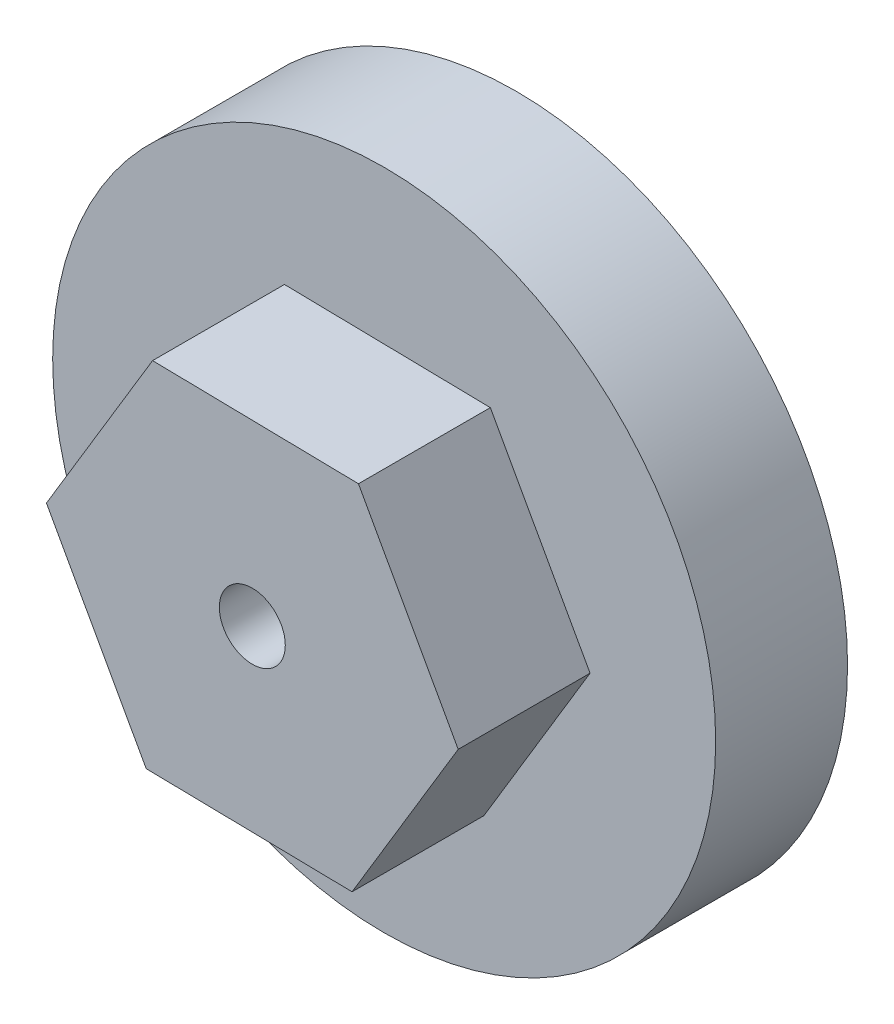
ISO-10303-21;
HEADER;
FILE_DESCRIPTION(('STEP AP214'),'2;1');
FILE_NAME('part.step','',(''),(''),'','','');
FILE_SCHEMA(('AUTOMOTIVE_DESIGN { 1 0 10303 214 1 1 1 1 }'));
ENDSEC;
DATA;
#1=APPLICATION_CONTEXT('core data for automotive mechanical design processes');
#2=APPLICATION_PROTOCOL_DEFINITION('international standard','automotive_design',2000,#1);
#3=PRODUCT_CONTEXT('',#1,'mechanical');
#4=PRODUCT('Part','Part','',(#3));
#5=PRODUCT_RELATED_PRODUCT_CATEGORY('part','',(#4));
#6=PRODUCT_DEFINITION_FORMATION('','',#4);
#7=PRODUCT_DEFINITION_CONTEXT('part definition',#1,'design');
#8=PRODUCT_DEFINITION('design','',#6,#7);
#9=PRODUCT_DEFINITION_SHAPE('','',#8);
#10=(LENGTH_UNIT() NAMED_UNIT(*) SI_UNIT(.MILLI.,.METRE.));
#11=(NAMED_UNIT(*) PLANE_ANGLE_UNIT() SI_UNIT($,.RADIAN.));
#12=(NAMED_UNIT(*) SI_UNIT($,.STERADIAN.) SOLID_ANGLE_UNIT());
#13=UNCERTAINTY_MEASURE_WITH_UNIT(LENGTH_MEASURE(1.E-05),#10,'distance_accuracy_value','');
#14=(GEOMETRIC_REPRESENTATION_CONTEXT(3) GLOBAL_UNCERTAINTY_ASSIGNED_CONTEXT((#13)) GLOBAL_UNIT_ASSIGNED_CONTEXT((#10,
#11,#12)) REPRESENTATION_CONTEXT('',''));
#15=CARTESIAN_POINT('',(0.,0.,0.));
#16=DIRECTION('',(0.,0.,1.));
#17=DIRECTION('',(1.,0.,0.));
#18=AXIS2_PLACEMENT_3D('',#15,#16,#17);
#19=CARTESIAN_POINT('',(0.,0.,10.));
#20=DIRECTION('',(0.,0.,-1.));
#21=DIRECTION('',(-1.,0.,0.));
#22=AXIS2_PLACEMENT_3D('',#19,#20,#21);
#23=CYLINDRICAL_SURFACE('',#22,25.1393111837615);
#24=CARTESIAN_POINT('',(0.,0.,10.));
#25=DIRECTION('',(0.,0.,1.));
#26=DIRECTION('',(1.,0.,0.));
#27=AXIS2_PLACEMENT_3D('',#24,#25,#26);
#28=CIRCLE('',#27,25.1393111837615);
#29=CARTESIAN_POINT('',(25.1393111837615,0.,10.));
#30=VERTEX_POINT('',#29);
#31=EDGE_CURVE('E11',#30,#30,#28,.T.);
#32=ORIENTED_EDGE('',*,*,#31,.F.);
#33=EDGE_LOOP('',(#32));
#34=FACE_BOUND('',#33,.T.);
#35=CARTESIAN_POINT('',(0.,0.,0.));
#36=DIRECTION('',(0.,0.,1.));
#37=DIRECTION('',(1.,0.,0.));
#38=AXIS2_PLACEMENT_3D('',#35,#36,#37);
#39=CIRCLE('',#38,25.1393111837615);
#40=CARTESIAN_POINT('',(25.1393111837615,0.,0.));
#41=VERTEX_POINT('',#40);
#42=EDGE_CURVE('E39',#41,#41,#39,.T.);
#43=ORIENTED_EDGE('',*,*,#42,.T.);
#44=EDGE_LOOP('',(#43));
#45=FACE_BOUND('',#44,.T.);
#46=ADVANCED_FACE('F36',(#34,#45),#23,.T.);
#47=CARTESIAN_POINT('',(0.,0.,10.));
#48=DIRECTION('',(0.,0.,1.));
#49=DIRECTION('',(1.,0.,0.));
#50=AXIS2_PLACEMENT_3D('',#47,#48,#49);
#51=PLANE('',#50);
#52=DIRECTION('',(-0.484355771750232,0.874871125579212,0.));
#53=VECTOR('',#52,1.);
#54=CARTESIAN_POINT('',(11.8305831403045,6.5497775153841,10.));
#55=LINE('',#54,#53);
#56=CARTESIAN_POINT('',(15.6120989519437,-0.280612845340982,10.));
#57=VERTEX_POINT('',#56);
#58=CARTESIAN_POINT('',(8.04906732866538,13.3801678761092,10.));
#59=VERTEX_POINT('',#58);
#60=EDGE_CURVE('E112',#57,#59,#55,.T.);
#61=ORIENTED_EDGE('',*,*,#60,.F.);
#62=DIRECTION('',(0.515482733913967,0.856899965594924,0.));
#63=VECTOR('',#62,1.);
#64=CARTESIAN_POINT('',(11.587565287611,-6.97069678339557,10.));
#65=LINE('',#64,#63);
#66=CARTESIAN_POINT('',(7.56303162327833,-13.6607807214502,10.));
#67=VERTEX_POINT('',#66);
#68=EDGE_CURVE('E109',#67,#57,#65,.T.);
#69=ORIENTED_EDGE('',*,*,#68,.F.);
#70=DIRECTION('',(0.9998385056642,-0.0179711599842875,0.));
#71=VECTOR('',#70,1.);
#72=CARTESIAN_POINT('',(-0.243017852693525,-13.5204742987797,10.));
#73=LINE('',#72,#71);
#74=CARTESIAN_POINT('',(-8.04906732866537,-13.3801678761092,10.));
#75=VERTEX_POINT('',#74);
#76=EDGE_CURVE('E119',#75,#67,#73,.T.);
#77=ORIENTED_EDGE('',*,*,#76,.F.);
#78=DIRECTION('',(0.484355771750232,-0.874871125579212,0.));
#79=VECTOR('',#78,1.);
#80=CARTESIAN_POINT('',(-11.8305831403045,-6.54977751538409,10.));
#81=LINE('',#80,#79);
#82=CARTESIAN_POINT('',(-15.6120989519437,0.280612845340986,10.));
#83=VERTEX_POINT('',#82);
#84=EDGE_CURVE('E122',#83,#75,#81,.T.);
#85=ORIENTED_EDGE('',*,*,#84,.F.);
#86=DIRECTION('',(-0.515482733913967,-0.856899965594924,0.));
#87=VECTOR('',#86,1.);
#88=CARTESIAN_POINT('',(-11.587565287611,6.97069678339557,10.));
#89=LINE('',#88,#87);
#90=CARTESIAN_POINT('',(-7.56303162327833,13.6607807214502,10.));
#91=VERTEX_POINT('',#90);
#92=EDGE_CURVE('E55',#91,#83,#89,.T.);
#93=ORIENTED_EDGE('',*,*,#92,.F.);
#94=DIRECTION('',(-0.9998385056642,0.0179711599842874,0.));
#95=VECTOR('',#94,1.);
#96=CARTESIAN_POINT('',(0.243017852693523,13.5204742987797,10.));
#97=LINE('',#96,#95);
#98=EDGE_CURVE('E44',#59,#91,#97,.T.);
#99=ORIENTED_EDGE('',*,*,#98,.F.);
#100=EDGE_LOOP('',(#61,#69,#77,#85,#93,#99));
#101=FACE_BOUND('',#100,.T.);
#102=ORIENTED_EDGE('',*,*,#31,.T.);
#103=EDGE_LOOP('',(#102));
#104=FACE_BOUND('',#103,.T.);
#105=ADVANCED_FACE('F167',(#101,#104),#51,.T.);
#106=CARTESIAN_POINT('',(0.,0.,0.));
#107=DIRECTION('',(0.,0.,1.));
#108=DIRECTION('',(1.,0.,0.));
#109=AXIS2_PLACEMENT_3D('',#106,#107,#108);
#110=PLANE('',#109);
#111=ORIENTED_EDGE('',*,*,#42,.F.);
#112=EDGE_LOOP('',(#111));
#113=FACE_BOUND('',#112,.T.);
#114=CARTESIAN_POINT('',(0.,0.,0.));
#115=DIRECTION('',(0.,0.,1.));
#116=DIRECTION('',(1.,0.,0.));
#117=AXIS2_PLACEMENT_3D('',#114,#115,#116);
#118=CIRCLE('',#117,2.5);
#119=CARTESIAN_POINT('',(2.5,0.,0.));
#120=VERTEX_POINT('',#119);
#121=EDGE_CURVE('E144',#120,#120,#118,.T.);
#122=ORIENTED_EDGE('',*,*,#121,.T.);
#123=EDGE_LOOP('',(#122));
#124=FACE_BOUND('',#123,.T.);
#125=ADVANCED_FACE('F172',(#113,#124),#110,.F.);
#126=CARTESIAN_POINT('',(11.587565287611,-6.97069678339557,20.));
#127=DIRECTION('',(-0.856899965594924,0.515482733913967,0.));
#128=DIRECTION('',(-0.515482733913967,-0.856899965594924,0.));
#129=AXIS2_PLACEMENT_3D('',#126,#127,#128);
#130=PLANE('',#129);
#131=ORIENTED_EDGE('',*,*,#68,.T.);
#132=DIRECTION('',(0.,0.,-1.));
#133=VECTOR('',#132,1.);
#134=CARTESIAN_POINT('',(15.6120989519437,-0.280612845340982,20.));
#135=LINE('',#134,#133);
#136=CARTESIAN_POINT('',(15.6120989519437,-0.280612845340982,20.));
#137=VERTEX_POINT('',#136);
#138=EDGE_CURVE('E90',#137,#57,#135,.T.);
#139=ORIENTED_EDGE('',*,*,#138,.F.);
#140=DIRECTION('',(0.515482733913967,0.856899965594924,0.));
#141=VECTOR('',#140,1.);
#142=CARTESIAN_POINT('',(11.587565287611,-6.97069678339557,20.));
#143=LINE('',#142,#141);
#144=CARTESIAN_POINT('',(7.56303162327833,-13.6607807214502,20.));
#145=VERTEX_POINT('',#144);
#146=EDGE_CURVE('E96',#145,#137,#143,.T.);
#147=ORIENTED_EDGE('',*,*,#146,.F.);
#148=DIRECTION('',(0.,0.,-1.));
#149=VECTOR('',#148,1.);
#150=CARTESIAN_POINT('',(7.56303162327833,-13.6607807214502,20.));
#151=LINE('',#150,#149);
#152=EDGE_CURVE('E142',#145,#67,#151,.T.);
#153=ORIENTED_EDGE('',*,*,#152,.T.);
#154=EDGE_LOOP('',(#131,#139,#147,#153));
#155=FACE_BOUND('',#154,.T.);
#156=ADVANCED_FACE('F108',(#155),#130,.F.);
#157=CARTESIAN_POINT('',(11.8305831403045,6.5497775153841,20.));
#158=DIRECTION('',(-0.874871125579212,-0.484355771750232,0.));
#159=DIRECTION('',(0.484355771750232,-0.874871125579212,0.));
#160=AXIS2_PLACEMENT_3D('',#157,#158,#159);
#161=PLANE('',#160);
#162=ORIENTED_EDGE('',*,*,#60,.T.);
#163=DIRECTION('',(0.,0.,-1.));
#164=VECTOR('',#163,1.);
#165=CARTESIAN_POINT('',(8.04906732866538,13.3801678761092,20.));
#166=LINE('',#165,#164);
#167=CARTESIAN_POINT('',(8.04906732866538,13.3801678761092,20.));
#168=VERTEX_POINT('',#167);
#169=EDGE_CURVE('E92',#168,#59,#166,.T.);
#170=ORIENTED_EDGE('',*,*,#169,.F.);
#171=DIRECTION('',(-0.484355771750232,0.874871125579212,0.));
#172=VECTOR('',#171,1.);
#173=CARTESIAN_POINT('',(11.8305831403045,6.5497775153841,20.));
#174=LINE('',#173,#172);
#175=EDGE_CURVE('E86',#137,#168,#174,.T.);
#176=ORIENTED_EDGE('',*,*,#175,.F.);
#177=ORIENTED_EDGE('',*,*,#138,.T.);
#178=EDGE_LOOP('',(#162,#170,#176,#177));
#179=FACE_BOUND('',#178,.T.);
#180=ADVANCED_FACE('F88',(#179),#161,.F.);
#181=CARTESIAN_POINT('',(0.243017852693523,13.5204742987797,20.));
#182=DIRECTION('',(-0.0179711599842874,-0.999838505664199,0.));
#183=DIRECTION('',(0.999838505664199,-0.0179711599842874,0.));
#184=AXIS2_PLACEMENT_3D('',#181,#182,#183);
#185=PLANE('',#184);
#186=ORIENTED_EDGE('',*,*,#98,.T.);
#187=DIRECTION('',(0.,0.,-1.));
#188=VECTOR('',#187,1.);
#189=CARTESIAN_POINT('',(-7.56303162327833,13.6607807214502,20.));
#190=LINE('',#189,#188);
#191=CARTESIAN_POINT('',(-7.56303162327833,13.6607807214502,20.));
#192=VERTEX_POINT('',#191);
#193=EDGE_CURVE('E113',#192,#91,#190,.T.);
#194=ORIENTED_EDGE('',*,*,#193,.F.);
#195=DIRECTION('',(-0.9998385056642,0.0179711599842874,0.));
#196=VECTOR('',#195,1.);
#197=CARTESIAN_POINT('',(0.243017852693523,13.5204742987797,20.));
#198=LINE('',#197,#196);
#199=EDGE_CURVE('E95',#168,#192,#198,.T.);
#200=ORIENTED_EDGE('',*,*,#199,.F.);
#201=ORIENTED_EDGE('',*,*,#169,.T.);
#202=EDGE_LOOP('',(#186,#194,#200,#201));
#203=FACE_BOUND('',#202,.T.);
#204=ADVANCED_FACE('F129',(#203),#185,.F.);
#205=CARTESIAN_POINT('',(-11.587565287611,6.97069678339557,20.));
#206=DIRECTION('',(0.856899965594924,-0.515482733913967,0.));
#207=DIRECTION('',(0.515482733913967,0.856899965594924,0.));
#208=AXIS2_PLACEMENT_3D('',#205,#206,#207);
#209=PLANE('',#208);
#210=ORIENTED_EDGE('',*,*,#92,.T.);
#211=DIRECTION('',(0.,0.,-1.));
#212=VECTOR('',#211,1.);
#213=CARTESIAN_POINT('',(-15.6120989519437,0.280612845340986,20.));
#214=LINE('',#213,#212);
#215=CARTESIAN_POINT('',(-15.6120989519437,0.280612845340986,20.));
#216=VERTEX_POINT('',#215);
#217=EDGE_CURVE('E136',#216,#83,#214,.T.);
#218=ORIENTED_EDGE('',*,*,#217,.F.);
#219=DIRECTION('',(-0.515482733913967,-0.856899965594924,0.));
#220=VECTOR('',#219,1.);
#221=CARTESIAN_POINT('',(-11.587565287611,6.97069678339557,20.));
#222=LINE('',#221,#220);
#223=EDGE_CURVE('E135',#192,#216,#222,.T.);
#224=ORIENTED_EDGE('',*,*,#223,.F.);
#225=ORIENTED_EDGE('',*,*,#193,.T.);
#226=EDGE_LOOP('',(#210,#218,#224,#225));
#227=FACE_BOUND('',#226,.T.);
#228=ADVANCED_FACE('F132',(#227),#209,.F.);
#229=CARTESIAN_POINT('',(-11.8305831403045,-6.54977751538409,20.));
#230=DIRECTION('',(0.874871125579212,0.484355771750232,0.));
#231=DIRECTION('',(-0.484355771750232,0.874871125579212,0.));
#232=AXIS2_PLACEMENT_3D('',#229,#230,#231);
#233=PLANE('',#232);
#234=ORIENTED_EDGE('',*,*,#84,.T.);
#235=DIRECTION('',(0.,0.,-1.));
#236=VECTOR('',#235,1.);
#237=CARTESIAN_POINT('',(-8.04906732866537,-13.3801678761092,20.));
#238=LINE('',#237,#236);
#239=CARTESIAN_POINT('',(-8.04906732866537,-13.3801678761092,20.));
#240=VERTEX_POINT('',#239);
#241=EDGE_CURVE('E137',#240,#75,#238,.T.);
#242=ORIENTED_EDGE('',*,*,#241,.F.);
#243=DIRECTION('',(0.484355771750232,-0.874871125579212,0.));
#244=VECTOR('',#243,1.);
#245=CARTESIAN_POINT('',(-11.8305831403045,-6.54977751538409,20.));
#246=LINE('',#245,#244);
#247=EDGE_CURVE('E148',#216,#240,#246,.T.);
#248=ORIENTED_EDGE('',*,*,#247,.F.);
#249=ORIENTED_EDGE('',*,*,#217,.T.);
#250=EDGE_LOOP('',(#234,#242,#248,#249));
#251=FACE_BOUND('',#250,.T.);
#252=ADVANCED_FACE('F182',(#251),#233,.F.);
#253=CARTESIAN_POINT('',(0.,0.,20.));
#254=DIRECTION('',(0.,0.,-1.));
#255=DIRECTION('',(-1.,0.,0.));
#256=AXIS2_PLACEMENT_3D('',#253,#254,#255);
#257=CYLINDRICAL_SURFACE('',#256,2.5);
#258=CARTESIAN_POINT('',(0.,0.,20.));
#259=DIRECTION('',(0.,0.,1.));
#260=DIRECTION('',(1.,0.,0.));
#261=AXIS2_PLACEMENT_3D('',#258,#259,#260);
#262=CIRCLE('',#261,2.5);
#263=CARTESIAN_POINT('',(2.5,0.,20.));
#264=VERTEX_POINT('',#263);
#265=EDGE_CURVE('E105',#264,#264,#262,.T.);
#266=ORIENTED_EDGE('',*,*,#265,.T.);
#267=EDGE_LOOP('',(#266));
#268=FACE_BOUND('',#267,.T.);
#269=ORIENTED_EDGE('',*,*,#121,.F.);
#270=EDGE_LOOP('',(#269));
#271=FACE_BOUND('',#270,.T.);
#272=ADVANCED_FACE('F155',(#268,#271),#257,.F.);
#273=CARTESIAN_POINT('',(-0.243017852693525,-13.5204742987797,20.));
#274=DIRECTION('',(0.0179711599842875,0.999838505664199,0.));
#275=DIRECTION('',(-0.999838505664199,0.0179711599842875,0.));
#276=AXIS2_PLACEMENT_3D('',#273,#274,#275);
#277=PLANE('',#276);
#278=ORIENTED_EDGE('',*,*,#76,.T.);
#279=ORIENTED_EDGE('',*,*,#152,.F.);
#280=DIRECTION('',(0.9998385056642,-0.0179711599842875,0.));
#281=VECTOR('',#280,1.);
#282=CARTESIAN_POINT('',(-0.243017852693525,-13.5204742987797,20.));
#283=LINE('',#282,#281);
#284=EDGE_CURVE('E101',#240,#145,#283,.T.);
#285=ORIENTED_EDGE('',*,*,#284,.F.);
#286=ORIENTED_EDGE('',*,*,#241,.T.);
#287=EDGE_LOOP('',(#278,#279,#285,#286));
#288=FACE_BOUND('',#287,.T.);
#289=ADVANCED_FACE('F159',(#288),#277,.F.);
#290=CARTESIAN_POINT('',(0.,0.,20.));
#291=DIRECTION('',(0.,0.,1.));
#292=DIRECTION('',(1.,0.,0.));
#293=AXIS2_PLACEMENT_3D('',#290,#291,#292);
#294=PLANE('',#293);
#295=ORIENTED_EDGE('',*,*,#265,.F.);
#296=EDGE_LOOP('',(#295));
#297=FACE_BOUND('',#296,.T.);
#298=ORIENTED_EDGE('',*,*,#146,.T.);
#299=ORIENTED_EDGE('',*,*,#175,.T.);
#300=ORIENTED_EDGE('',*,*,#199,.T.);
#301=ORIENTED_EDGE('',*,*,#223,.T.);
#302=ORIENTED_EDGE('',*,*,#247,.T.);
#303=ORIENTED_EDGE('',*,*,#284,.T.);
#304=EDGE_LOOP('',(#298,#299,#300,#301,#302,#303));
#305=FACE_BOUND('',#304,.T.);
#306=ADVANCED_FACE('F99',(#297,#305),#294,.T.);
#307=CLOSED_SHELL('',(#46,#105,#125,#156,#180,#204,#228,#252,#272,#289,#306));
#308=MANIFOLD_SOLID_BREP('B2',#307);
#309=ADVANCED_BREP_SHAPE_REPRESENTATION('',(#18,#308),#14);
#310=SHAPE_DEFINITION_REPRESENTATION(#9,#309);
ENDSEC;
END-ISO-10303-21;
